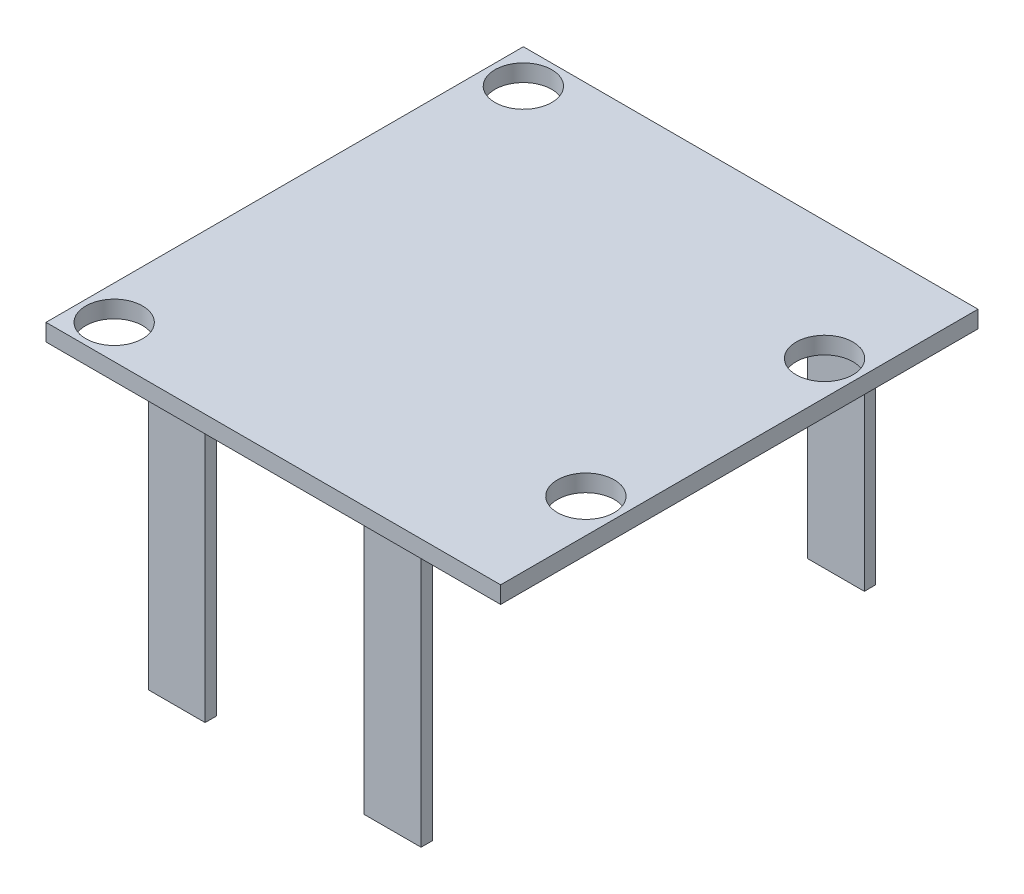
ISO-10303-21;
HEADER;
FILE_DESCRIPTION(('STEP AP214'),'2;1');
FILE_NAME('part.step','',(''),(''),'','','');
FILE_SCHEMA(('AUTOMOTIVE_DESIGN { 1 0 10303 214 1 1 1 1 }'));
ENDSEC;
DATA;
#1=APPLICATION_CONTEXT('core data for automotive mechanical design processes');
#2=APPLICATION_PROTOCOL_DEFINITION('international standard','automotive_design',2000,#1);
#3=PRODUCT_CONTEXT('',#1,'mechanical');
#4=PRODUCT('Part','Part','',(#3));
#5=PRODUCT_RELATED_PRODUCT_CATEGORY('part','',(#4));
#6=PRODUCT_DEFINITION_FORMATION('','',#4);
#7=PRODUCT_DEFINITION_CONTEXT('part definition',#1,'design');
#8=PRODUCT_DEFINITION('design','',#6,#7);
#9=PRODUCT_DEFINITION_SHAPE('','',#8);
#10=(LENGTH_UNIT() NAMED_UNIT(*) SI_UNIT(.MILLI.,.METRE.));
#11=(NAMED_UNIT(*) PLANE_ANGLE_UNIT() SI_UNIT($,.RADIAN.));
#12=(NAMED_UNIT(*) SI_UNIT($,.STERADIAN.) SOLID_ANGLE_UNIT());
#13=UNCERTAINTY_MEASURE_WITH_UNIT(LENGTH_MEASURE(1.E-05),#10,'distance_accuracy_value','');
#14=(GEOMETRIC_REPRESENTATION_CONTEXT(3) GLOBAL_UNCERTAINTY_ASSIGNED_CONTEXT((#13)) GLOBAL_UNIT_ASSIGNED_CONTEXT((#10,
#11,#12)) REPRESENTATION_CONTEXT('',''));
#15=CARTESIAN_POINT('',(0.,0.,0.));
#16=DIRECTION('',(0.,0.,1.));
#17=DIRECTION('',(1.,0.,0.));
#18=AXIS2_PLACEMENT_3D('',#15,#16,#17);
#19=CARTESIAN_POINT('',(0.,0.,0.));
#20=DIRECTION('',(0.,1.,0.));
#21=DIRECTION('',(0.,0.,1.));
#22=AXIS2_PLACEMENT_3D('',#19,#20,#21);
#23=PLANE('',#22);
#24=DIRECTION('',(0.,0.,-1.));
#25=VECTOR('',#24,1.);
#26=CARTESIAN_POINT('',(-120.,0.,-200.));
#27=LINE('',#26,#25);
#28=CARTESIAN_POINT('',(-120.,0.,-190.));
#29=VERTEX_POINT('',#28);
#30=CARTESIAN_POINT('',(-120.,0.,-200.));
#31=VERTEX_POINT('',#30);
#32=EDGE_CURVE('E203',#29,#31,#27,.T.);
#33=ORIENTED_EDGE('',*,*,#32,.F.);
#34=DIRECTION('',(-1.,0.,0.));
#35=VECTOR('',#34,1.);
#36=CARTESIAN_POINT('',(-120.,0.,-190.));
#37=LINE('',#36,#35);
#38=CARTESIAN_POINT('',(-70.,0.,-190.));
#39=VERTEX_POINT('',#38);
#40=EDGE_CURVE('E219',#39,#29,#37,.T.);
#41=ORIENTED_EDGE('',*,*,#40,.F.);
#42=DIRECTION('',(0.,0.,1.));
#43=VECTOR('',#42,1.);
#44=CARTESIAN_POINT('',(-70.,0.,-200.));
#45=LINE('',#44,#43);
#46=CARTESIAN_POINT('',(-70.,0.,-200.));
#47=VERTEX_POINT('',#46);
#48=EDGE_CURVE('E232',#47,#39,#45,.T.);
#49=ORIENTED_EDGE('',*,*,#48,.F.);
#50=DIRECTION('',(1.,0.,0.));
#51=VECTOR('',#50,1.);
#52=CARTESIAN_POINT('',(-120.,0.,-200.));
#53=LINE('',#52,#51);
#54=EDGE_CURVE('E208',#31,#47,#53,.T.);
#55=ORIENTED_EDGE('',*,*,#54,.F.);
#56=EDGE_LOOP('',(#33,#41,#49,#55));
#57=FACE_BOUND('',#56,.T.);
#58=DIRECTION('',(0.,0.,-1.));
#59=VECTOR('',#58,1.);
#60=CARTESIAN_POINT('',(-120.,0.,200.));
#61=LINE('',#60,#59);
#62=CARTESIAN_POINT('',(-120.,0.,200.));
#63=VERTEX_POINT('',#62);
#64=CARTESIAN_POINT('',(-120.,0.,190.));
#65=VERTEX_POINT('',#64);
#66=EDGE_CURVE('E299',#63,#65,#61,.T.);
#67=ORIENTED_EDGE('',*,*,#66,.F.);
#68=DIRECTION('',(-1.,0.,0.));
#69=VECTOR('',#68,1.);
#70=CARTESIAN_POINT('',(-120.,0.,200.));
#71=LINE('',#70,#69);
#72=CARTESIAN_POINT('',(-70.,0.,200.));
#73=VERTEX_POINT('',#72);
#74=EDGE_CURVE('E305',#73,#63,#71,.T.);
#75=ORIENTED_EDGE('',*,*,#74,.F.);
#76=DIRECTION('',(0.,0.,1.));
#77=VECTOR('',#76,1.);
#78=CARTESIAN_POINT('',(-70.,0.,200.));
#79=LINE('',#78,#77);
#80=CARTESIAN_POINT('',(-70.,0.,190.));
#81=VERTEX_POINT('',#80);
#82=EDGE_CURVE('E322',#81,#73,#79,.T.);
#83=ORIENTED_EDGE('',*,*,#82,.F.);
#84=DIRECTION('',(1.,0.,0.));
#85=VECTOR('',#84,1.);
#86=CARTESIAN_POINT('',(-120.,0.,190.));
#87=LINE('',#86,#85);
#88=EDGE_CURVE('E318',#65,#81,#87,.T.);
#89=ORIENTED_EDGE('',*,*,#88,.F.);
#90=EDGE_LOOP('',(#67,#75,#83,#89));
#91=FACE_BOUND('',#90,.T.);
#92=CARTESIAN_POINT('',(-170.,0.,-180.));
#93=DIRECTION('',(0.,1.,0.));
#94=DIRECTION('',(0.,0.,1.));
#95=AXIS2_PLACEMENT_3D('',#92,#93,#94);
#96=CIRCLE('',#95,25.);
#97=CARTESIAN_POINT('',(-170.,0.,-155.));
#98=VERTEX_POINT('',#97);
#99=EDGE_CURVE('E349',#98,#98,#96,.F.);
#100=ORIENTED_EDGE('',*,*,#99,.F.);
#101=EDGE_LOOP('',(#100));
#102=FACE_BOUND('',#101,.T.);
#103=CARTESIAN_POINT('',(-170.,0.,180.));
#104=DIRECTION('',(0.,1.,0.));
#105=DIRECTION('',(0.,0.,1.));
#106=AXIS2_PLACEMENT_3D('',#103,#104,#105);
#107=CIRCLE('',#106,25.);
#108=CARTESIAN_POINT('',(-170.,0.,205.));
#109=VERTEX_POINT('',#108);
#110=EDGE_CURVE('E350',#109,#109,#107,.F.);
#111=ORIENTED_EDGE('',*,*,#110,.F.);
#112=EDGE_LOOP('',(#111));
#113=FACE_BOUND('',#112,.T.);
#114=CARTESIAN_POINT('',(170.,0.,105.));
#115=DIRECTION('',(0.,1.,0.));
#116=DIRECTION('',(0.,0.,1.));
#117=AXIS2_PLACEMENT_3D('',#114,#115,#116);
#118=CIRCLE('',#117,25.);
#119=CARTESIAN_POINT('',(170.,0.,130.));
#120=VERTEX_POINT('',#119);
#121=EDGE_CURVE('E359',#120,#120,#118,.F.);
#122=ORIENTED_EDGE('',*,*,#121,.F.);
#123=EDGE_LOOP('',(#122));
#124=FACE_BOUND('',#123,.T.);
#125=CARTESIAN_POINT('',(170.,0.,-105.));
#126=DIRECTION('',(0.,1.,0.));
#127=DIRECTION('',(0.,0.,1.));
#128=AXIS2_PLACEMENT_3D('',#125,#126,#127);
#129=CIRCLE('',#128,25.);
#130=CARTESIAN_POINT('',(170.,0.,-79.9999999999999));
#131=VERTEX_POINT('',#130);
#132=EDGE_CURVE('E367',#131,#131,#129,.F.);
#133=ORIENTED_EDGE('',*,*,#132,.F.);
#134=EDGE_LOOP('',(#133));
#135=FACE_BOUND('',#134,.T.);
#136=DIRECTION('',(0.,0.,-1.));
#137=VECTOR('',#136,1.);
#138=CARTESIAN_POINT('',(200.,0.,-210.));
#139=LINE('',#138,#137);
#140=CARTESIAN_POINT('',(200.,0.,210.));
#141=VERTEX_POINT('',#140);
#142=CARTESIAN_POINT('',(200.,0.,-210.));
#143=VERTEX_POINT('',#142);
#144=EDGE_CURVE('E354',#141,#143,#139,.T.);
#145=ORIENTED_EDGE('',*,*,#144,.F.);
#146=DIRECTION('',(1.,0.,0.));
#147=VECTOR('',#146,1.);
#148=CARTESIAN_POINT('',(-200.,0.,210.));
#149=LINE('',#148,#147);
#150=CARTESIAN_POINT('',(-200.,0.,210.));
#151=VERTEX_POINT('',#150);
#152=EDGE_CURVE('E382',#151,#141,#149,.T.);
#153=ORIENTED_EDGE('',*,*,#152,.F.);
#154=DIRECTION('',(0.,0.,1.));
#155=VECTOR('',#154,1.);
#156=CARTESIAN_POINT('',(-200.,0.,-210.));
#157=LINE('',#156,#155);
#158=CARTESIAN_POINT('',(-200.,0.,-210.));
#159=VERTEX_POINT('',#158);
#160=EDGE_CURVE('E398',#159,#151,#157,.T.);
#161=ORIENTED_EDGE('',*,*,#160,.F.);
#162=DIRECTION('',(-1.,0.,0.));
#163=VECTOR('',#162,1.);
#164=CARTESIAN_POINT('',(-200.,0.,-210.));
#165=LINE('',#164,#163);
#166=EDGE_CURVE('E395',#143,#159,#165,.T.);
#167=ORIENTED_EDGE('',*,*,#166,.F.);
#168=EDGE_LOOP('',(#145,#153,#161,#167));
#169=FACE_BOUND('',#168,.T.);
#170=DIRECTION('',(0.,0.,-1.));
#171=VECTOR('',#170,1.);
#172=CARTESIAN_POINT('',(70.0000000000001,0.,200.));
#173=LINE('',#172,#171);
#174=CARTESIAN_POINT('',(70.0000000000001,0.,200.));
#175=VERTEX_POINT('',#174);
#176=CARTESIAN_POINT('',(70.0000000000001,0.,190.));
#177=VERTEX_POINT('',#176);
#178=EDGE_CURVE('E254',#175,#177,#173,.T.);
#179=ORIENTED_EDGE('',*,*,#178,.F.);
#180=DIRECTION('',(-1.,0.,0.));
#181=VECTOR('',#180,1.);
#182=CARTESIAN_POINT('',(70.0000000000001,0.,200.));
#183=LINE('',#182,#181);
#184=CARTESIAN_POINT('',(120.,0.,200.));
#185=VERTEX_POINT('',#184);
#186=EDGE_CURVE('E260',#185,#175,#183,.T.);
#187=ORIENTED_EDGE('',*,*,#186,.F.);
#188=DIRECTION('',(0.,0.,1.));
#189=VECTOR('',#188,1.);
#190=CARTESIAN_POINT('',(120.,0.,200.));
#191=LINE('',#190,#189);
#192=CARTESIAN_POINT('',(120.,0.,190.));
#193=VERTEX_POINT('',#192);
#194=EDGE_CURVE('E277',#193,#185,#191,.T.);
#195=ORIENTED_EDGE('',*,*,#194,.F.);
#196=DIRECTION('',(1.,0.,0.));
#197=VECTOR('',#196,1.);
#198=CARTESIAN_POINT('',(70.0000000000001,0.,190.));
#199=LINE('',#198,#197);
#200=EDGE_CURVE('E273',#177,#193,#199,.T.);
#201=ORIENTED_EDGE('',*,*,#200,.F.);
#202=EDGE_LOOP('',(#179,#187,#195,#201));
#203=FACE_BOUND('',#202,.T.);
#204=DIRECTION('',(0.,0.,-1.));
#205=VECTOR('',#204,1.);
#206=CARTESIAN_POINT('',(70.0000000000001,0.,-200.));
#207=LINE('',#206,#205);
#208=CARTESIAN_POINT('',(70.0000000000001,0.,-190.));
#209=VERTEX_POINT('',#208);
#210=CARTESIAN_POINT('',(70.0000000000001,0.,-200.));
#211=VERTEX_POINT('',#210);
#212=EDGE_CURVE('E201',#209,#211,#207,.T.);
#213=ORIENTED_EDGE('',*,*,#212,.F.);
#214=DIRECTION('',(-1.,0.,0.));
#215=VECTOR('',#214,1.);
#216=CARTESIAN_POINT('',(70.0000000000001,0.,-190.));
#217=LINE('',#216,#215);
#218=CARTESIAN_POINT('',(120.,0.,-190.));
#219=VERTEX_POINT('',#218);
#220=EDGE_CURVE('E198',#219,#209,#217,.T.);
#221=ORIENTED_EDGE('',*,*,#220,.F.);
#222=DIRECTION('',(0.,0.,1.));
#223=VECTOR('',#222,1.);
#224=CARTESIAN_POINT('',(120.,0.,-200.));
#225=LINE('',#224,#223);
#226=CARTESIAN_POINT('',(120.,0.,-200.));
#227=VERTEX_POINT('',#226);
#228=EDGE_CURVE('E62',#227,#219,#225,.T.);
#229=ORIENTED_EDGE('',*,*,#228,.F.);
#230=DIRECTION('',(1.,0.,0.));
#231=VECTOR('',#230,1.);
#232=CARTESIAN_POINT('',(70.0000000000001,0.,-200.));
#233=LINE('',#232,#231);
#234=EDGE_CURVE('E57',#211,#227,#233,.T.);
#235=ORIENTED_EDGE('',*,*,#234,.F.);
#236=EDGE_LOOP('',(#213,#221,#229,#235));
#237=FACE_BOUND('',#236,.T.);
#238=ADVANCED_FACE('F41',(#57,#91,#102,#113,#124,#135,#169,#203,#237),#23,.F.);
#239=CARTESIAN_POINT('',(200.,15.,-210.));
#240=DIRECTION('',(-1.,0.,0.));
#241=DIRECTION('',(0.,0.,1.));
#242=AXIS2_PLACEMENT_3D('',#239,#240,#241);
#243=PLANE('',#242);
#244=ORIENTED_EDGE('',*,*,#144,.T.);
#245=DIRECTION('',(0.,-1.,0.));
#246=VECTOR('',#245,1.);
#247=CARTESIAN_POINT('',(200.,15.,-210.));
#248=LINE('',#247,#246);
#249=CARTESIAN_POINT('',(200.,15.,-210.));
#250=VERTEX_POINT('',#249);
#251=EDGE_CURVE('E11',#250,#143,#248,.T.);
#252=ORIENTED_EDGE('',*,*,#251,.F.);
#253=DIRECTION('',(0.,0.,-1.));
#254=VECTOR('',#253,1.);
#255=CARTESIAN_POINT('',(200.,15.,-210.));
#256=LINE('',#255,#254);
#257=CARTESIAN_POINT('',(200.,15.,210.));
#258=VERTEX_POINT('',#257);
#259=EDGE_CURVE('E377',#258,#250,#256,.T.);
#260=ORIENTED_EDGE('',*,*,#259,.F.);
#261=DIRECTION('',(0.,-1.,0.));
#262=VECTOR('',#261,1.);
#263=CARTESIAN_POINT('',(200.,15.,210.));
#264=LINE('',#263,#262);
#265=EDGE_CURVE('E391',#258,#141,#264,.T.);
#266=ORIENTED_EDGE('',*,*,#265,.T.);
#267=EDGE_LOOP('',(#244,#252,#260,#266));
#268=FACE_BOUND('',#267,.T.);
#269=ADVANCED_FACE('F43',(#268),#243,.F.);
#270=CARTESIAN_POINT('',(-200.,15.,-210.));
#271=DIRECTION('',(0.,0.,1.));
#272=DIRECTION('',(1.,0.,0.));
#273=AXIS2_PLACEMENT_3D('',#270,#271,#272);
#274=PLANE('',#273);
#275=ORIENTED_EDGE('',*,*,#166,.T.);
#276=DIRECTION('',(0.,-1.,0.));
#277=VECTOR('',#276,1.);
#278=CARTESIAN_POINT('',(-200.,15.,-210.));
#279=LINE('',#278,#277);
#280=CARTESIAN_POINT('',(-200.,15.,-210.));
#281=VERTEX_POINT('',#280);
#282=EDGE_CURVE('E50',#281,#159,#279,.T.);
#283=ORIENTED_EDGE('',*,*,#282,.F.);
#284=DIRECTION('',(-1.,0.,0.));
#285=VECTOR('',#284,1.);
#286=CARTESIAN_POINT('',(-200.,15.,-210.));
#287=LINE('',#286,#285);
#288=EDGE_CURVE('E381',#250,#281,#287,.T.);
#289=ORIENTED_EDGE('',*,*,#288,.F.);
#290=ORIENTED_EDGE('',*,*,#251,.T.);
#291=EDGE_LOOP('',(#275,#283,#289,#290));
#292=FACE_BOUND('',#291,.T.);
#293=ADVANCED_FACE('F431',(#292),#274,.F.);
#294=CARTESIAN_POINT('',(-200.,15.,-210.));
#295=DIRECTION('',(1.,0.,0.));
#296=DIRECTION('',(0.,0.,-1.));
#297=AXIS2_PLACEMENT_3D('',#294,#295,#296);
#298=PLANE('',#297);
#299=ORIENTED_EDGE('',*,*,#160,.T.);
#300=DIRECTION('',(0.,-1.,0.));
#301=VECTOR('',#300,1.);
#302=CARTESIAN_POINT('',(-200.,15.,210.));
#303=LINE('',#302,#301);
#304=CARTESIAN_POINT('',(-200.,15.,210.));
#305=VERTEX_POINT('',#304);
#306=EDGE_CURVE('E406',#305,#151,#303,.T.);
#307=ORIENTED_EDGE('',*,*,#306,.F.);
#308=DIRECTION('',(0.,0.,1.));
#309=VECTOR('',#308,1.);
#310=CARTESIAN_POINT('',(-200.,15.,-210.));
#311=LINE('',#310,#309);
#312=EDGE_CURVE('E385',#281,#305,#311,.T.);
#313=ORIENTED_EDGE('',*,*,#312,.F.);
#314=ORIENTED_EDGE('',*,*,#282,.T.);
#315=EDGE_LOOP('',(#299,#307,#313,#314));
#316=FACE_BOUND('',#315,.T.);
#317=ADVANCED_FACE('F415',(#316),#298,.F.);
#318=CARTESIAN_POINT('',(-200.,15.,210.));
#319=DIRECTION('',(0.,0.,-1.));
#320=DIRECTION('',(-1.,0.,0.));
#321=AXIS2_PLACEMENT_3D('',#318,#319,#320);
#322=PLANE('',#321);
#323=ORIENTED_EDGE('',*,*,#152,.T.);
#324=ORIENTED_EDGE('',*,*,#265,.F.);
#325=DIRECTION('',(1.,0.,0.));
#326=VECTOR('',#325,1.);
#327=CARTESIAN_POINT('',(-200.,15.,210.));
#328=LINE('',#327,#326);
#329=EDGE_CURVE('E388',#305,#258,#328,.T.);
#330=ORIENTED_EDGE('',*,*,#329,.F.);
#331=ORIENTED_EDGE('',*,*,#306,.T.);
#332=EDGE_LOOP('',(#323,#324,#330,#331));
#333=FACE_BOUND('',#332,.T.);
#334=ADVANCED_FACE('F424',(#333),#322,.F.);
#335=CARTESIAN_POINT('',(0.,15.,0.));
#336=DIRECTION('',(0.,1.,0.));
#337=DIRECTION('',(0.,0.,1.));
#338=AXIS2_PLACEMENT_3D('',#335,#336,#337);
#339=PLANE('',#338);
#340=CARTESIAN_POINT('',(-170.,15.,-180.));
#341=DIRECTION('',(0.,1.,0.));
#342=DIRECTION('',(0.,0.,1.));
#343=AXIS2_PLACEMENT_3D('',#340,#341,#342);
#344=CIRCLE('',#343,25.);
#345=CARTESIAN_POINT('',(-170.,15.,-155.));
#346=VERTEX_POINT('',#345);
#347=EDGE_CURVE('E345',#346,#346,#344,.T.);
#348=ORIENTED_EDGE('',*,*,#347,.F.);
#349=EDGE_LOOP('',(#348));
#350=FACE_BOUND('',#349,.T.);
#351=CARTESIAN_POINT('',(-170.,15.,180.));
#352=DIRECTION('',(0.,1.,0.));
#353=DIRECTION('',(0.,0.,1.));
#354=AXIS2_PLACEMENT_3D('',#351,#352,#353);
#355=CIRCLE('',#354,25.);
#356=CARTESIAN_POINT('',(-170.,15.,205.));
#357=VERTEX_POINT('',#356);
#358=EDGE_CURVE('E355',#357,#357,#355,.T.);
#359=ORIENTED_EDGE('',*,*,#358,.F.);
#360=EDGE_LOOP('',(#359));
#361=FACE_BOUND('',#360,.T.);
#362=CARTESIAN_POINT('',(170.,15.,105.));
#363=DIRECTION('',(0.,1.,0.));
#364=DIRECTION('',(0.,0.,1.));
#365=AXIS2_PLACEMENT_3D('',#362,#363,#364);
#366=CIRCLE('',#365,25.);
#367=CARTESIAN_POINT('',(170.,15.,130.));
#368=VERTEX_POINT('',#367);
#369=EDGE_CURVE('E363',#368,#368,#366,.T.);
#370=ORIENTED_EDGE('',*,*,#369,.F.);
#371=EDGE_LOOP('',(#370));
#372=FACE_BOUND('',#371,.T.);
#373=CARTESIAN_POINT('',(170.,15.,-105.));
#374=DIRECTION('',(0.,1.,0.));
#375=DIRECTION('',(0.,0.,1.));
#376=AXIS2_PLACEMENT_3D('',#373,#374,#375);
#377=CIRCLE('',#376,25.);
#378=CARTESIAN_POINT('',(170.,15.,-79.9999999999999));
#379=VERTEX_POINT('',#378);
#380=EDGE_CURVE('E344',#379,#379,#377,.T.);
#381=ORIENTED_EDGE('',*,*,#380,.F.);
#382=EDGE_LOOP('',(#381));
#383=FACE_BOUND('',#382,.T.);
#384=ORIENTED_EDGE('',*,*,#259,.T.);
#385=ORIENTED_EDGE('',*,*,#288,.T.);
#386=ORIENTED_EDGE('',*,*,#312,.T.);
#387=ORIENTED_EDGE('',*,*,#329,.T.);
#388=EDGE_LOOP('',(#384,#385,#386,#387));
#389=FACE_BOUND('',#388,.T.);
#390=ADVANCED_FACE('F430',(#350,#361,#372,#383,#389),#339,.T.);
#391=CARTESIAN_POINT('',(170.,-70.7106781186548,-105.));
#392=DIRECTION('',(0.,1.,0.));
#393=DIRECTION('',(0.,0.,1.));
#394=AXIS2_PLACEMENT_3D('',#391,#392,#393);
#395=CYLINDRICAL_SURFACE('',#394,25.);
#396=ORIENTED_EDGE('',*,*,#132,.T.);
#397=EDGE_LOOP('',(#396));
#398=FACE_BOUND('',#397,.T.);
#399=ORIENTED_EDGE('',*,*,#380,.T.);
#400=EDGE_LOOP('',(#399));
#401=FACE_BOUND('',#400,.T.);
#402=ADVANCED_FACE('F453',(#398,#401),#395,.F.);
#403=CARTESIAN_POINT('',(170.,-70.7106781186548,105.));
#404=DIRECTION('',(0.,1.,0.));
#405=DIRECTION('',(0.,0.,1.));
#406=AXIS2_PLACEMENT_3D('',#403,#404,#405);
#407=CYLINDRICAL_SURFACE('',#406,25.);
#408=ORIENTED_EDGE('',*,*,#121,.T.);
#409=EDGE_LOOP('',(#408));
#410=FACE_BOUND('',#409,.T.);
#411=ORIENTED_EDGE('',*,*,#369,.T.);
#412=EDGE_LOOP('',(#411));
#413=FACE_BOUND('',#412,.T.);
#414=ADVANCED_FACE('F459',(#410,#413),#407,.F.);
#415=CARTESIAN_POINT('',(-170.,-70.7106781186548,180.));
#416=DIRECTION('',(0.,1.,0.));
#417=DIRECTION('',(0.,0.,1.));
#418=AXIS2_PLACEMENT_3D('',#415,#416,#417);
#419=CYLINDRICAL_SURFACE('',#418,25.);
#420=ORIENTED_EDGE('',*,*,#110,.T.);
#421=EDGE_LOOP('',(#420));
#422=FACE_BOUND('',#421,.T.);
#423=ORIENTED_EDGE('',*,*,#358,.T.);
#424=EDGE_LOOP('',(#423));
#425=FACE_BOUND('',#424,.T.);
#426=ADVANCED_FACE('F471',(#422,#425),#419,.F.);
#427=CARTESIAN_POINT('',(-170.,-70.7106781186548,-180.));
#428=DIRECTION('',(0.,1.,0.));
#429=DIRECTION('',(0.,0.,1.));
#430=AXIS2_PLACEMENT_3D('',#427,#428,#429);
#431=CYLINDRICAL_SURFACE('',#430,25.);
#432=ORIENTED_EDGE('',*,*,#99,.T.);
#433=EDGE_LOOP('',(#432));
#434=FACE_BOUND('',#433,.T.);
#435=ORIENTED_EDGE('',*,*,#347,.T.);
#436=EDGE_LOOP('',(#435));
#437=FACE_BOUND('',#436,.T.);
#438=ADVANCED_FACE('F477',(#434,#437),#431,.F.);
#439=CARTESIAN_POINT('',(-120.,-230.,200.));
#440=DIRECTION('',(1.,0.,0.));
#441=DIRECTION('',(0.,0.,-1.));
#442=AXIS2_PLACEMENT_3D('',#439,#440,#441);
#443=PLANE('',#442);
#444=ORIENTED_EDGE('',*,*,#66,.T.);
#445=DIRECTION('',(0.,1.,0.));
#446=VECTOR('',#445,1.);
#447=CARTESIAN_POINT('',(-120.,-230.,190.));
#448=LINE('',#447,#446);
#449=CARTESIAN_POINT('',(-120.,-230.,190.));
#450=VERTEX_POINT('',#449);
#451=EDGE_CURVE('E340',#450,#65,#448,.T.);
#452=ORIENTED_EDGE('',*,*,#451,.F.);
#453=DIRECTION('',(0.,0.,-1.));
#454=VECTOR('',#453,1.);
#455=CARTESIAN_POINT('',(-120.,-230.,200.));
#456=LINE('',#455,#454);
#457=CARTESIAN_POINT('',(-120.,-230.,200.));
#458=VERTEX_POINT('',#457);
#459=EDGE_CURVE('E300',#458,#450,#456,.T.);
#460=ORIENTED_EDGE('',*,*,#459,.F.);
#461=DIRECTION('',(0.,1.,0.));
#462=VECTOR('',#461,1.);
#463=CARTESIAN_POINT('',(-120.,-230.,200.));
#464=LINE('',#463,#462);
#465=EDGE_CURVE('E314',#458,#63,#464,.T.);
#466=ORIENTED_EDGE('',*,*,#465,.T.);
#467=EDGE_LOOP('',(#444,#452,#460,#466));
#468=FACE_BOUND('',#467,.T.);
#469=ADVANCED_FACE('F483',(#468),#443,.F.);
#470=CARTESIAN_POINT('',(-120.,-230.,190.));
#471=DIRECTION('',(0.,0.,1.));
#472=DIRECTION('',(1.,0.,0.));
#473=AXIS2_PLACEMENT_3D('',#470,#471,#472);
#474=PLANE('',#473);
#475=ORIENTED_EDGE('',*,*,#88,.T.);
#476=DIRECTION('',(0.,1.,0.));
#477=VECTOR('',#476,1.);
#478=CARTESIAN_POINT('',(-70.,-230.,190.));
#479=LINE('',#478,#477);
#480=CARTESIAN_POINT('',(-70.,-230.,190.));
#481=VERTEX_POINT('',#480);
#482=EDGE_CURVE('E336',#481,#81,#479,.T.);
#483=ORIENTED_EDGE('',*,*,#482,.F.);
#484=DIRECTION('',(1.,0.,0.));
#485=VECTOR('',#484,1.);
#486=CARTESIAN_POINT('',(-120.,-230.,190.));
#487=LINE('',#486,#485);
#488=EDGE_CURVE('E304',#450,#481,#487,.T.);
#489=ORIENTED_EDGE('',*,*,#488,.F.);
#490=ORIENTED_EDGE('',*,*,#451,.T.);
#491=EDGE_LOOP('',(#475,#483,#489,#490));
#492=FACE_BOUND('',#491,.T.);
#493=ADVANCED_FACE('F487',(#492),#474,.F.);
#494=CARTESIAN_POINT('',(-70.,-230.,200.));
#495=DIRECTION('',(-1.,0.,0.));
#496=DIRECTION('',(0.,0.,1.));
#497=AXIS2_PLACEMENT_3D('',#494,#495,#496);
#498=PLANE('',#497);
#499=ORIENTED_EDGE('',*,*,#82,.T.);
#500=DIRECTION('',(0.,1.,0.));
#501=VECTOR('',#500,1.);
#502=CARTESIAN_POINT('',(-70.,-230.,200.));
#503=LINE('',#502,#501);
#504=CARTESIAN_POINT('',(-70.,-230.,200.));
#505=VERTEX_POINT('',#504);
#506=EDGE_CURVE('E332',#505,#73,#503,.T.);
#507=ORIENTED_EDGE('',*,*,#506,.F.);
#508=DIRECTION('',(0.,0.,1.));
#509=VECTOR('',#508,1.);
#510=CARTESIAN_POINT('',(-70.,-230.,200.));
#511=LINE('',#510,#509);
#512=EDGE_CURVE('E308',#481,#505,#511,.T.);
#513=ORIENTED_EDGE('',*,*,#512,.F.);
#514=ORIENTED_EDGE('',*,*,#482,.T.);
#515=EDGE_LOOP('',(#499,#507,#513,#514));
#516=FACE_BOUND('',#515,.T.);
#517=ADVANCED_FACE('F491',(#516),#498,.F.);
#518=CARTESIAN_POINT('',(-120.,-230.,200.));
#519=DIRECTION('',(0.,0.,-1.));
#520=DIRECTION('',(-1.,0.,0.));
#521=AXIS2_PLACEMENT_3D('',#518,#519,#520);
#522=PLANE('',#521);
#523=ORIENTED_EDGE('',*,*,#74,.T.);
#524=ORIENTED_EDGE('',*,*,#465,.F.);
#525=DIRECTION('',(-1.,0.,0.));
#526=VECTOR('',#525,1.);
#527=CARTESIAN_POINT('',(-120.,-230.,200.));
#528=LINE('',#527,#526);
#529=EDGE_CURVE('E311',#505,#458,#528,.T.);
#530=ORIENTED_EDGE('',*,*,#529,.F.);
#531=ORIENTED_EDGE('',*,*,#506,.T.);
#532=EDGE_LOOP('',(#523,#524,#530,#531));
#533=FACE_BOUND('',#532,.T.);
#534=ADVANCED_FACE('F495',(#533),#522,.F.);
#535=CARTESIAN_POINT('',(0.,-230.,0.));
#536=DIRECTION('',(0.,-1.,0.));
#537=DIRECTION('',(0.,0.,-1.));
#538=AXIS2_PLACEMENT_3D('',#535,#536,#537);
#539=PLANE('',#538);
#540=ORIENTED_EDGE('',*,*,#459,.T.);
#541=ORIENTED_EDGE('',*,*,#488,.T.);
#542=ORIENTED_EDGE('',*,*,#512,.T.);
#543=ORIENTED_EDGE('',*,*,#529,.T.);
#544=EDGE_LOOP('',(#540,#541,#542,#543));
#545=FACE_BOUND('',#544,.T.);
#546=ADVANCED_FACE('F499',(#545),#539,.T.);
#547=CARTESIAN_POINT('',(70.0000000000001,-230.,200.));
#548=DIRECTION('',(1.,0.,0.));
#549=DIRECTION('',(0.,0.,-1.));
#550=AXIS2_PLACEMENT_3D('',#547,#548,#549);
#551=PLANE('',#550);
#552=ORIENTED_EDGE('',*,*,#178,.T.);
#553=DIRECTION('',(0.,1.,0.));
#554=VECTOR('',#553,1.);
#555=CARTESIAN_POINT('',(70.0000000000001,-230.,190.));
#556=LINE('',#555,#554);
#557=CARTESIAN_POINT('',(70.0000000000001,-230.,190.));
#558=VERTEX_POINT('',#557);
#559=EDGE_CURVE('E295',#558,#177,#556,.T.);
#560=ORIENTED_EDGE('',*,*,#559,.F.);
#561=DIRECTION('',(0.,0.,-1.));
#562=VECTOR('',#561,1.);
#563=CARTESIAN_POINT('',(70.0000000000001,-230.,200.));
#564=LINE('',#563,#562);
#565=CARTESIAN_POINT('',(70.0000000000001,-230.,200.));
#566=VERTEX_POINT('',#565);
#567=EDGE_CURVE('E255',#566,#558,#564,.T.);
#568=ORIENTED_EDGE('',*,*,#567,.F.);
#569=DIRECTION('',(0.,1.,0.));
#570=VECTOR('',#569,1.);
#571=CARTESIAN_POINT('',(70.0000000000001,-230.,200.));
#572=LINE('',#571,#570);
#573=EDGE_CURVE('E269',#566,#175,#572,.T.);
#574=ORIENTED_EDGE('',*,*,#573,.T.);
#575=EDGE_LOOP('',(#552,#560,#568,#574));
#576=FACE_BOUND('',#575,.T.);
#577=ADVANCED_FACE('F503',(#576),#551,.F.);
#578=CARTESIAN_POINT('',(70.0000000000001,-230.,190.));
#579=DIRECTION('',(0.,0.,1.));
#580=DIRECTION('',(1.,0.,0.));
#581=AXIS2_PLACEMENT_3D('',#578,#579,#580);
#582=PLANE('',#581);
#583=ORIENTED_EDGE('',*,*,#200,.T.);
#584=DIRECTION('',(0.,1.,0.));
#585=VECTOR('',#584,1.);
#586=CARTESIAN_POINT('',(120.,-230.,190.));
#587=LINE('',#586,#585);
#588=CARTESIAN_POINT('',(120.,-230.,190.));
#589=VERTEX_POINT('',#588);
#590=EDGE_CURVE('E291',#589,#193,#587,.T.);
#591=ORIENTED_EDGE('',*,*,#590,.F.);
#592=DIRECTION('',(1.,0.,0.));
#593=VECTOR('',#592,1.);
#594=CARTESIAN_POINT('',(70.0000000000001,-230.,190.));
#595=LINE('',#594,#593);
#596=EDGE_CURVE('E259',#558,#589,#595,.T.);
#597=ORIENTED_EDGE('',*,*,#596,.F.);
#598=ORIENTED_EDGE('',*,*,#559,.T.);
#599=EDGE_LOOP('',(#583,#591,#597,#598));
#600=FACE_BOUND('',#599,.T.);
#601=ADVANCED_FACE('F507',(#600),#582,.F.);
#602=CARTESIAN_POINT('',(120.,-230.,200.));
#603=DIRECTION('',(-1.,0.,0.));
#604=DIRECTION('',(0.,0.,1.));
#605=AXIS2_PLACEMENT_3D('',#602,#603,#604);
#606=PLANE('',#605);
#607=ORIENTED_EDGE('',*,*,#194,.T.);
#608=DIRECTION('',(0.,1.,0.));
#609=VECTOR('',#608,1.);
#610=CARTESIAN_POINT('',(120.,-230.,200.));
#611=LINE('',#610,#609);
#612=CARTESIAN_POINT('',(120.,-230.,200.));
#613=VERTEX_POINT('',#612);
#614=EDGE_CURVE('E287',#613,#185,#611,.T.);
#615=ORIENTED_EDGE('',*,*,#614,.F.);
#616=DIRECTION('',(0.,0.,1.));
#617=VECTOR('',#616,1.);
#618=CARTESIAN_POINT('',(120.,-230.,200.));
#619=LINE('',#618,#617);
#620=EDGE_CURVE('E263',#589,#613,#619,.T.);
#621=ORIENTED_EDGE('',*,*,#620,.F.);
#622=ORIENTED_EDGE('',*,*,#590,.T.);
#623=EDGE_LOOP('',(#607,#615,#621,#622));
#624=FACE_BOUND('',#623,.T.);
#625=ADVANCED_FACE('F511',(#624),#606,.F.);
#626=CARTESIAN_POINT('',(70.0000000000001,-230.,200.));
#627=DIRECTION('',(0.,0.,-1.));
#628=DIRECTION('',(-1.,0.,0.));
#629=AXIS2_PLACEMENT_3D('',#626,#627,#628);
#630=PLANE('',#629);
#631=ORIENTED_EDGE('',*,*,#186,.T.);
#632=ORIENTED_EDGE('',*,*,#573,.F.);
#633=DIRECTION('',(-1.,0.,0.));
#634=VECTOR('',#633,1.);
#635=CARTESIAN_POINT('',(70.0000000000001,-230.,200.));
#636=LINE('',#635,#634);
#637=EDGE_CURVE('E266',#613,#566,#636,.T.);
#638=ORIENTED_EDGE('',*,*,#637,.F.);
#639=ORIENTED_EDGE('',*,*,#614,.T.);
#640=EDGE_LOOP('',(#631,#632,#638,#639));
#641=FACE_BOUND('',#640,.T.);
#642=ADVANCED_FACE('F515',(#641),#630,.F.);
#643=CARTESIAN_POINT('',(0.,-230.,0.));
#644=DIRECTION('',(0.,-1.,0.));
#645=DIRECTION('',(0.,0.,-1.));
#646=AXIS2_PLACEMENT_3D('',#643,#644,#645);
#647=PLANE('',#646);
#648=ORIENTED_EDGE('',*,*,#567,.T.);
#649=ORIENTED_EDGE('',*,*,#596,.T.);
#650=ORIENTED_EDGE('',*,*,#620,.T.);
#651=ORIENTED_EDGE('',*,*,#637,.T.);
#652=EDGE_LOOP('',(#648,#649,#650,#651));
#653=FACE_BOUND('',#652,.T.);
#654=ADVANCED_FACE('F519',(#653),#647,.T.);
#655=CARTESIAN_POINT('',(-120.,-230.,-200.));
#656=DIRECTION('',(1.,0.,0.));
#657=DIRECTION('',(0.,0.,-1.));
#658=AXIS2_PLACEMENT_3D('',#655,#656,#657);
#659=PLANE('',#658);
#660=ORIENTED_EDGE('',*,*,#32,.T.);
#661=DIRECTION('',(0.,1.,0.));
#662=VECTOR('',#661,1.);
#663=CARTESIAN_POINT('',(-120.,-230.,-200.));
#664=LINE('',#663,#662);
#665=CARTESIAN_POINT('',(-120.,-230.,-200.));
#666=VERTEX_POINT('',#665);
#667=EDGE_CURVE('E250',#666,#31,#664,.T.);
#668=ORIENTED_EDGE('',*,*,#667,.F.);
#669=DIRECTION('',(0.,0.,-1.));
#670=VECTOR('',#669,1.);
#671=CARTESIAN_POINT('',(-120.,-230.,-200.));
#672=LINE('',#671,#670);
#673=CARTESIAN_POINT('',(-120.,-230.,-190.));
#674=VERTEX_POINT('',#673);
#675=EDGE_CURVE('E214',#674,#666,#672,.T.);
#676=ORIENTED_EDGE('',*,*,#675,.F.);
#677=DIRECTION('',(0.,1.,0.));
#678=VECTOR('',#677,1.);
#679=CARTESIAN_POINT('',(-120.,-230.,-190.));
#680=LINE('',#679,#678);
#681=EDGE_CURVE('E227',#674,#29,#680,.T.);
#682=ORIENTED_EDGE('',*,*,#681,.T.);
#683=EDGE_LOOP('',(#660,#668,#676,#682));
#684=FACE_BOUND('',#683,.T.);
#685=ADVANCED_FACE('F523',(#684),#659,.F.);
#686=CARTESIAN_POINT('',(-120.,-230.,-200.));
#687=DIRECTION('',(0.,0.,1.));
#688=DIRECTION('',(1.,0.,0.));
#689=AXIS2_PLACEMENT_3D('',#686,#687,#688);
#690=PLANE('',#689);
#691=ORIENTED_EDGE('',*,*,#54,.T.);
#692=DIRECTION('',(0.,1.,0.));
#693=VECTOR('',#692,1.);
#694=CARTESIAN_POINT('',(-70.,-230.,-200.));
#695=LINE('',#694,#693);
#696=CARTESIAN_POINT('',(-70.,-230.,-200.));
#697=VERTEX_POINT('',#696);
#698=EDGE_CURVE('E246',#697,#47,#695,.T.);
#699=ORIENTED_EDGE('',*,*,#698,.F.);
#700=DIRECTION('',(1.,0.,0.));
#701=VECTOR('',#700,1.);
#702=CARTESIAN_POINT('',(-120.,-230.,-200.));
#703=LINE('',#702,#701);
#704=EDGE_CURVE('E218',#666,#697,#703,.T.);
#705=ORIENTED_EDGE('',*,*,#704,.F.);
#706=ORIENTED_EDGE('',*,*,#667,.T.);
#707=EDGE_LOOP('',(#691,#699,#705,#706));
#708=FACE_BOUND('',#707,.T.);
#709=ADVANCED_FACE('F527',(#708),#690,.F.);
#710=CARTESIAN_POINT('',(-70.,-230.,-200.));
#711=DIRECTION('',(-1.,0.,0.));
#712=DIRECTION('',(0.,0.,1.));
#713=AXIS2_PLACEMENT_3D('',#710,#711,#712);
#714=PLANE('',#713);
#715=ORIENTED_EDGE('',*,*,#48,.T.);
#716=DIRECTION('',(0.,1.,0.));
#717=VECTOR('',#716,1.);
#718=CARTESIAN_POINT('',(-70.,-230.,-190.));
#719=LINE('',#718,#717);
#720=CARTESIAN_POINT('',(-70.,-230.,-190.));
#721=VERTEX_POINT('',#720);
#722=EDGE_CURVE('E242',#721,#39,#719,.T.);
#723=ORIENTED_EDGE('',*,*,#722,.F.);
#724=DIRECTION('',(0.,0.,1.));
#725=VECTOR('',#724,1.);
#726=CARTESIAN_POINT('',(-70.,-230.,-200.));
#727=LINE('',#726,#725);
#728=EDGE_CURVE('E222',#697,#721,#727,.T.);
#729=ORIENTED_EDGE('',*,*,#728,.F.);
#730=ORIENTED_EDGE('',*,*,#698,.T.);
#731=EDGE_LOOP('',(#715,#723,#729,#730));
#732=FACE_BOUND('',#731,.T.);
#733=ADVANCED_FACE('F531',(#732),#714,.F.);
#734=CARTESIAN_POINT('',(-120.,-230.,-190.));
#735=DIRECTION('',(0.,0.,-1.));
#736=DIRECTION('',(-1.,0.,0.));
#737=AXIS2_PLACEMENT_3D('',#734,#735,#736);
#738=PLANE('',#737);
#739=ORIENTED_EDGE('',*,*,#40,.T.);
#740=ORIENTED_EDGE('',*,*,#681,.F.);
#741=DIRECTION('',(-1.,0.,0.));
#742=VECTOR('',#741,1.);
#743=CARTESIAN_POINT('',(-120.,-230.,-190.));
#744=LINE('',#743,#742);
#745=EDGE_CURVE('E225',#721,#674,#744,.T.);
#746=ORIENTED_EDGE('',*,*,#745,.F.);
#747=ORIENTED_EDGE('',*,*,#722,.T.);
#748=EDGE_LOOP('',(#739,#740,#746,#747));
#749=FACE_BOUND('',#748,.T.);
#750=ADVANCED_FACE('F535',(#749),#738,.F.);
#751=CARTESIAN_POINT('',(0.,-230.,0.));
#752=DIRECTION('',(0.,1.,0.));
#753=DIRECTION('',(0.,0.,1.));
#754=AXIS2_PLACEMENT_3D('',#751,#752,#753);
#755=PLANE('',#754);
#756=ORIENTED_EDGE('',*,*,#675,.T.);
#757=ORIENTED_EDGE('',*,*,#704,.T.);
#758=ORIENTED_EDGE('',*,*,#728,.T.);
#759=ORIENTED_EDGE('',*,*,#745,.T.);
#760=EDGE_LOOP('',(#756,#757,#758,#759));
#761=FACE_BOUND('',#760,.T.);
#762=ADVANCED_FACE('F539',(#761),#755,.F.);
#763=CARTESIAN_POINT('',(70.0000000000001,-230.,-200.));
#764=DIRECTION('',(1.,0.,0.));
#765=DIRECTION('',(0.,0.,-1.));
#766=AXIS2_PLACEMENT_3D('',#763,#764,#765);
#767=PLANE('',#766);
#768=ORIENTED_EDGE('',*,*,#212,.T.);
#769=DIRECTION('',(0.,1.,0.));
#770=VECTOR('',#769,1.);
#771=CARTESIAN_POINT('',(70.0000000000001,-230.,-200.));
#772=LINE('',#771,#770);
#773=CARTESIAN_POINT('',(70.0000000000001,-230.,-200.));
#774=VERTEX_POINT('',#773);
#775=EDGE_CURVE('E180',#774,#211,#772,.T.);
#776=ORIENTED_EDGE('',*,*,#775,.F.);
#777=DIRECTION('',(0.,0.,-1.));
#778=VECTOR('',#777,1.);
#779=CARTESIAN_POINT('',(70.0000000000001,-230.,-200.));
#780=LINE('',#779,#778);
#781=CARTESIAN_POINT('',(70.0000000000001,-230.,-190.));
#782=VERTEX_POINT('',#781);
#783=EDGE_CURVE('E188',#782,#774,#780,.T.);
#784=ORIENTED_EDGE('',*,*,#783,.F.);
#785=DIRECTION('',(0.,1.,0.));
#786=VECTOR('',#785,1.);
#787=CARTESIAN_POINT('',(70.0000000000001,-230.,-190.));
#788=LINE('',#787,#786);
#789=EDGE_CURVE('E770',#782,#209,#788,.T.);
#790=ORIENTED_EDGE('',*,*,#789,.T.);
#791=EDGE_LOOP('',(#768,#776,#784,#790));
#792=FACE_BOUND('',#791,.T.);
#793=ADVANCED_FACE('F200',(#792),#767,.F.);
#794=CARTESIAN_POINT('',(70.0000000000001,-230.,-200.));
#795=DIRECTION('',(0.,0.,1.));
#796=DIRECTION('',(1.,0.,0.));
#797=AXIS2_PLACEMENT_3D('',#794,#795,#796);
#798=PLANE('',#797);
#799=ORIENTED_EDGE('',*,*,#234,.T.);
#800=DIRECTION('',(0.,1.,0.));
#801=VECTOR('',#800,1.);
#802=CARTESIAN_POINT('',(120.,-230.,-200.));
#803=LINE('',#802,#801);
#804=CARTESIAN_POINT('',(120.,-230.,-200.));
#805=VERTEX_POINT('',#804);
#806=EDGE_CURVE('E183',#805,#227,#803,.T.);
#807=ORIENTED_EDGE('',*,*,#806,.F.);
#808=DIRECTION('',(1.,0.,0.));
#809=VECTOR('',#808,1.);
#810=CARTESIAN_POINT('',(70.0000000000001,-230.,-200.));
#811=LINE('',#810,#809);
#812=EDGE_CURVE('E176',#774,#805,#811,.T.);
#813=ORIENTED_EDGE('',*,*,#812,.F.);
#814=ORIENTED_EDGE('',*,*,#775,.T.);
#815=EDGE_LOOP('',(#799,#807,#813,#814));
#816=FACE_BOUND('',#815,.T.);
#817=ADVANCED_FACE('F178',(#816),#798,.F.);
#818=CARTESIAN_POINT('',(120.,-230.,-200.));
#819=DIRECTION('',(-1.,0.,0.));
#820=DIRECTION('',(0.,0.,1.));
#821=AXIS2_PLACEMENT_3D('',#818,#819,#820);
#822=PLANE('',#821);
#823=ORIENTED_EDGE('',*,*,#228,.T.);
#824=DIRECTION('',(0.,1.,0.));
#825=VECTOR('',#824,1.);
#826=CARTESIAN_POINT('',(120.,-230.,-190.));
#827=LINE('',#826,#825);
#828=CARTESIAN_POINT('',(120.,-230.,-190.));
#829=VERTEX_POINT('',#828);
#830=EDGE_CURVE('E210',#829,#219,#827,.T.);
#831=ORIENTED_EDGE('',*,*,#830,.F.);
#832=DIRECTION('',(0.,0.,1.));
#833=VECTOR('',#832,1.);
#834=CARTESIAN_POINT('',(120.,-230.,-200.));
#835=LINE('',#834,#833);
#836=EDGE_CURVE('E187',#805,#829,#835,.T.);
#837=ORIENTED_EDGE('',*,*,#836,.F.);
#838=ORIENTED_EDGE('',*,*,#806,.T.);
#839=EDGE_LOOP('',(#823,#831,#837,#838));
#840=FACE_BOUND('',#839,.T.);
#841=ADVANCED_FACE('F548',(#840),#822,.F.);
#842=CARTESIAN_POINT('',(70.0000000000001,-230.,-190.));
#843=DIRECTION('',(0.,0.,-1.));
#844=DIRECTION('',(-1.,0.,0.));
#845=AXIS2_PLACEMENT_3D('',#842,#843,#844);
#846=PLANE('',#845);
#847=ORIENTED_EDGE('',*,*,#220,.T.);
#848=ORIENTED_EDGE('',*,*,#789,.F.);
#849=DIRECTION('',(-1.,0.,0.));
#850=VECTOR('',#849,1.);
#851=CARTESIAN_POINT('',(70.0000000000001,-230.,-190.));
#852=LINE('',#851,#850);
#853=EDGE_CURVE('E193',#829,#782,#852,.T.);
#854=ORIENTED_EDGE('',*,*,#853,.F.);
#855=ORIENTED_EDGE('',*,*,#830,.T.);
#856=EDGE_LOOP('',(#847,#848,#854,#855));
#857=FACE_BOUND('',#856,.T.);
#858=ADVANCED_FACE('F551',(#857),#846,.F.);
#859=CARTESIAN_POINT('',(0.,-230.,0.));
#860=DIRECTION('',(0.,1.,0.));
#861=DIRECTION('',(0.,0.,1.));
#862=AXIS2_PLACEMENT_3D('',#859,#860,#861);
#863=PLANE('',#862);
#864=ORIENTED_EDGE('',*,*,#783,.T.);
#865=ORIENTED_EDGE('',*,*,#812,.T.);
#866=ORIENTED_EDGE('',*,*,#836,.T.);
#867=ORIENTED_EDGE('',*,*,#853,.T.);
#868=EDGE_LOOP('',(#864,#865,#866,#867));
#869=FACE_BOUND('',#868,.T.);
#870=ADVANCED_FACE('F191',(#869),#863,.F.);
#871=CLOSED_SHELL('',(#238,#269,#293,#317,#334,#390,#402,#414,#426,#438,#469,#493,#517,#534,
#546,#577,#601,#625,#642,#654,#685,#709,#733,#750,#762,#793,#817,#841,#858,#870));
#872=MANIFOLD_SOLID_BREP('B2',#871);
#873=ADVANCED_BREP_SHAPE_REPRESENTATION('',(#18,#872),#14);
#874=SHAPE_DEFINITION_REPRESENTATION(#9,#873);
ENDSEC;
END-ISO-10303-21;
